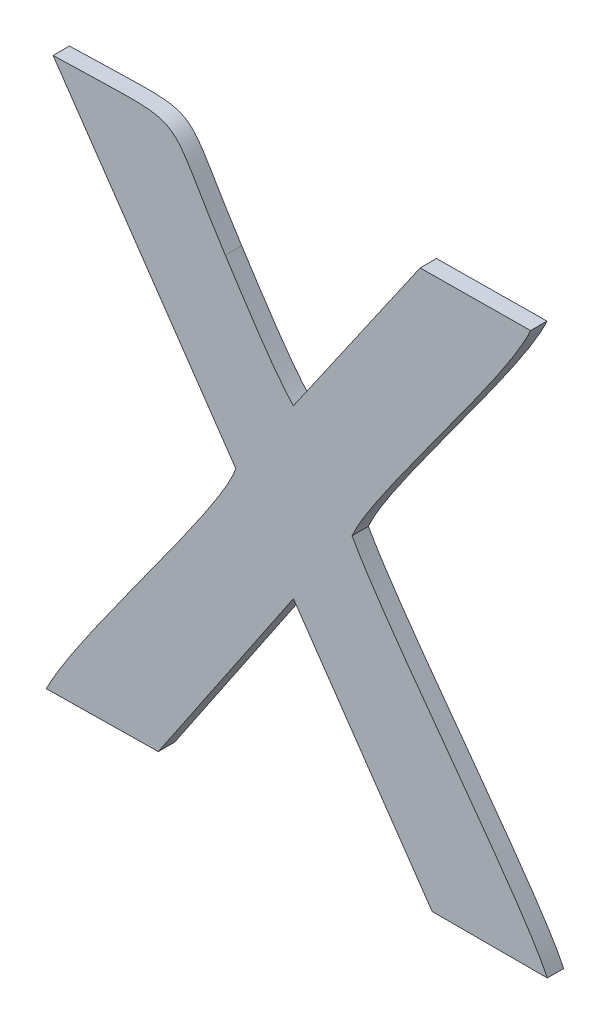
ISO-10303-21;
HEADER;
FILE_DESCRIPTION(('STEP AP214'),'2;1');
FILE_NAME('part.step','',(''),(''),'','','');
FILE_SCHEMA(('AUTOMOTIVE_DESIGN { 1 0 10303 214 1 1 1 1 }'));
ENDSEC;
DATA;
#1=APPLICATION_CONTEXT('core data for automotive mechanical design processes');
#2=APPLICATION_PROTOCOL_DEFINITION('international standard','automotive_design',2000,#1);
#3=PRODUCT_CONTEXT('',#1,'mechanical');
#4=PRODUCT('Part','Part','',(#3));
#5=PRODUCT_RELATED_PRODUCT_CATEGORY('part','',(#4));
#6=PRODUCT_DEFINITION_FORMATION('','',#4);
#7=PRODUCT_DEFINITION_CONTEXT('part definition',#1,'design');
#8=PRODUCT_DEFINITION('design','',#6,#7);
#9=PRODUCT_DEFINITION_SHAPE('','',#8);
#10=(LENGTH_UNIT() NAMED_UNIT(*) SI_UNIT(.MILLI.,.METRE.));
#11=(NAMED_UNIT(*) PLANE_ANGLE_UNIT() SI_UNIT($,.RADIAN.));
#12=(NAMED_UNIT(*) SI_UNIT($,.STERADIAN.) SOLID_ANGLE_UNIT());
#13=UNCERTAINTY_MEASURE_WITH_UNIT(LENGTH_MEASURE(1.E-05),#10,'distance_accuracy_value','');
#14=(GEOMETRIC_REPRESENTATION_CONTEXT(3) GLOBAL_UNCERTAINTY_ASSIGNED_CONTEXT((#13)) GLOBAL_UNIT_ASSIGNED_CONTEXT((#10,
#11,#12)) REPRESENTATION_CONTEXT('',''));
#15=CARTESIAN_POINT('',(0.,0.,0.));
#16=DIRECTION('',(0.,0.,1.));
#17=DIRECTION('',(1.,0.,0.));
#18=AXIS2_PLACEMENT_3D('',#15,#16,#17);
#19=CARTESIAN_POINT('',(-1.8810139453125,-48.558446796875,0.000999999999999998));
#20=CARTESIAN_POINT('',(-1.8810139453125,-48.558446796875,0.));
#21=CARTESIAN_POINT('',(-1.88219765625,-48.5572630859375,0.000999999999999998));
#22=CARTESIAN_POINT('',(-1.88219765625,-48.5572630859375,0.));
#23=CARTESIAN_POINT('',(-1.8842131640625,-48.554031875,0.000999999999999998));
#24=CARTESIAN_POINT('',(-1.8842131640625,-48.554031875,0.));
#25=CARTESIAN_POINT('',(-1.8851729296875,-48.552560234375,0.000999999999999998));
#26=CARTESIAN_POINT('',(-1.8851729296875,-48.552560234375,0.));
#27=B_SPLINE_SURFACE_WITH_KNOTS('',3,1,((#19,#20),(#21,#22),(#23,#24),(#25,#26)),.UNSPECIFIED.,
.F.,.F.,.F.,(4,4),(2,2),(0.692307692307692,0.769230769230769),(0.,1.),.UNSPECIFIED.);
#28=CARTESIAN_POINT('',(-1.8810139453125,-48.558446796875,0.));
#29=CARTESIAN_POINT('',(-1.88219765625,-48.5572630859375,0.));
#30=CARTESIAN_POINT('',(-1.8842131640625,-48.554031875,0.));
#31=CARTESIAN_POINT('',(-1.8851729296875,-48.552560234375,0.));
#32=B_SPLINE_CURVE_WITH_KNOTS('',3,(#28,#29,#30,#31),.UNSPECIFIED.,.F.,.F.,(4,4),
(0.692307692307692,0.769230769230769),.UNSPECIFIED.);
#33=CARTESIAN_POINT('',(-1.8810139453125,-48.558446796875,0.));
#34=VERTEX_POINT('',#33);
#35=CARTESIAN_POINT('',(-1.8851729296875,-48.552560234375,0.));
#36=VERTEX_POINT('',#35);
#37=EDGE_CURVE('E11',#34,#36,#32,.T.);
#38=DIRECTION('',(0.,0.,-1.));
#39=VECTOR('',#38,1.);
#40=CARTESIAN_POINT('',(-1.8851729296875,-48.552560234375,0.000999999999999998));
#41=LINE('',#40,#39);
#42=CARTESIAN_POINT('',(-1.8851729296875,-48.552560234375,0.000999999999999998));
#43=VERTEX_POINT('',#42);
#44=EDGE_CURVE('E28',#43,#36,#41,.T.);
#45=CARTESIAN_POINT('',(-1.8810139453125,-48.558446796875,0.001));
#46=CARTESIAN_POINT('',(-1.88219765625,-48.5572630859375,0.000999999999999998));
#47=CARTESIAN_POINT('',(-1.8842131640625,-48.554031875,0.000999999999999998));
#48=CARTESIAN_POINT('',(-1.8851729296875,-48.552560234375,0.000999999999999998));
#49=B_SPLINE_CURVE_WITH_KNOTS('',3,(#45,#46,#47,#48),.UNSPECIFIED.,.F.,.F.,(4,4),
(0.692307692307692,0.769230769230769),.UNSPECIFIED.);
#50=CARTESIAN_POINT('',(-1.8810139453125,-48.558446796875,0.001));
#51=VERTEX_POINT('',#50);
#52=EDGE_CURVE('E241',#51,#43,#49,.T.);
#53=DIRECTION('',(0.,0.,-1.));
#54=VECTOR('',#53,1.);
#55=CARTESIAN_POINT('',(-1.8810139453125,-48.558446796875,0.001));
#56=LINE('',#55,#54);
#57=EDGE_CURVE('E40',#51,#34,#56,.T.);
#58=ORIENTED_EDGE('',*,*,#37,.T.);
#59=ORIENTED_EDGE('',*,*,#44,.F.);
#60=ORIENTED_EDGE('',*,*,#52,.F.);
#61=ORIENTED_EDGE('',*,*,#57,.T.);
#62=EDGE_LOOP('',(#58,#59,#60,#61));
#63=FACE_BOUND('',#62,.T.);
#64=ADVANCED_FACE('F17',(#63),#27,.F.);
#65=CARTESIAN_POINT('',(-1.8851729296875,-48.552560234375,0.001));
#66=CARTESIAN_POINT('',(-1.8851729296875,-48.552560234375,0.));
#67=CARTESIAN_POINT('',(-1.8892359375,-48.5463217578125,0.001));
#68=CARTESIAN_POINT('',(-1.8892359375,-48.5463217578125,0.));
#69=CARTESIAN_POINT('',(-1.8869325,-48.5470895703125,0.001));
#70=CARTESIAN_POINT('',(-1.8869325,-48.5470895703125,0.));
#71=CARTESIAN_POINT('',(-1.895698359375,-48.54724953125,0.001));
#72=CARTESIAN_POINT('',(-1.895698359375,-48.54724953125,0.));
#73=B_SPLINE_SURFACE_WITH_KNOTS('',3,1,((#65,#66),(#67,#68),(#69,#70),(#71,#72)),.UNSPECIFIED.,
.F.,.F.,.F.,(4,4),(2,2),(0.769230769230769,0.846153846153846),(0.,1.),.UNSPECIFIED.);
#74=CARTESIAN_POINT('',(-1.8851729296875,-48.552560234375,0.));
#75=CARTESIAN_POINT('',(-1.8892359375,-48.5463217578125,0.));
#76=CARTESIAN_POINT('',(-1.8869325,-48.5470895703125,0.));
#77=CARTESIAN_POINT('',(-1.895698359375,-48.54724953125,0.));
#78=B_SPLINE_CURVE_WITH_KNOTS('',3,(#74,#75,#76,#77),.UNSPECIFIED.,.F.,.F.,(4,4),
(0.769230769230769,0.846153846153846),.UNSPECIFIED.);
#79=CARTESIAN_POINT('',(-1.895698359375,-48.54724953125,0.));
#80=VERTEX_POINT('',#79);
#81=EDGE_CURVE('E233',#36,#80,#78,.T.);
#82=DIRECTION('',(0.,0.,-1.));
#83=VECTOR('',#82,1.);
#84=CARTESIAN_POINT('',(-1.895698359375,-48.54724953125,0.001));
#85=LINE('',#84,#83);
#86=CARTESIAN_POINT('',(-1.895698359375,-48.54724953125,0.001));
#87=VERTEX_POINT('',#86);
#88=EDGE_CURVE('E228',#87,#80,#85,.T.);
#89=CARTESIAN_POINT('',(-1.8851729296875,-48.552560234375,0.000999999999999998));
#90=CARTESIAN_POINT('',(-1.8892359375,-48.5463217578125,0.001));
#91=CARTESIAN_POINT('',(-1.8869325,-48.5470895703125,0.001));
#92=CARTESIAN_POINT('',(-1.895698359375,-48.54724953125,0.001));
#93=B_SPLINE_CURVE_WITH_KNOTS('',3,(#89,#90,#91,#92),.UNSPECIFIED.,.F.,.F.,(4,4),
(0.769230769230769,0.846153846153846),.UNSPECIFIED.);
#94=EDGE_CURVE('E224',#43,#87,#93,.T.);
#95=ORIENTED_EDGE('',*,*,#81,.T.);
#96=ORIENTED_EDGE('',*,*,#88,.F.);
#97=ORIENTED_EDGE('',*,*,#94,.F.);
#98=ORIENTED_EDGE('',*,*,#44,.T.);
#99=EDGE_LOOP('',(#95,#96,#97,#98));
#100=FACE_BOUND('',#99,.T.);
#101=ADVANCED_FACE('F249',(#100),#73,.F.);
#102=CARTESIAN_POINT('',(-23.9316149900033,-16.4089069381147,0.001));
#103=DIRECTION('',(0.824750443714158,0.565496866121554,0.));
#104=DIRECTION('',(-0.565496866121554,0.824750443714158,0.));
#105=AXIS2_PLACEMENT_3D('',#102,#103,#104);
#106=PLANE('',#105);
#107=DIRECTION('',(0.565496866121554,-0.824750443714158,0.));
#108=VECTOR('',#107,1.);
#109=CARTESIAN_POINT('',(-23.9316149900033,-16.4089069381147,0.));
#110=LINE('',#109,#108);
#111=CARTESIAN_POINT('',(-1.8845330859375,-48.5635335546875,0.));
#112=VERTEX_POINT('',#111);
#113=EDGE_CURVE('E222',#80,#112,#110,.T.);
#114=ORIENTED_EDGE('',*,*,#113,.T.);
#115=DIRECTION('',(0.,0.,-1.));
#116=VECTOR('',#115,1.);
#117=CARTESIAN_POINT('',(-1.8845330859375,-48.5635335546875,0.001));
#118=LINE('',#117,#116);
#119=CARTESIAN_POINT('',(-1.8845330859375,-48.5635335546875,0.001));
#120=VERTEX_POINT('',#119);
#121=EDGE_CURVE('E219',#120,#112,#118,.T.);
#122=ORIENTED_EDGE('',*,*,#121,.F.);
#123=DIRECTION('',(0.565496866121554,-0.824750443714158,0.));
#124=VECTOR('',#123,1.);
#125=CARTESIAN_POINT('',(-23.9316149900033,-16.4089069381147,0.001));
#126=LINE('',#125,#124);
#127=EDGE_CURVE('E213',#87,#120,#126,.T.);
#128=ORIENTED_EDGE('',*,*,#127,.F.);
#129=ORIENTED_EDGE('',*,*,#88,.T.);
#130=EDGE_LOOP('',(#114,#122,#128,#129));
#131=FACE_BOUND('',#130,.T.);
#132=ADVANCED_FACE('F253',(#131),#106,.F.);
#133=CARTESIAN_POINT('',(-1.8845330859375,-48.5635335546875,0.001));
#134=CARTESIAN_POINT('',(-1.8845330859375,-48.5635335546875,0.));
#135=CARTESIAN_POINT('',(-1.885460859375,-48.566316875,0.001));
#136=CARTESIAN_POINT('',(-1.885460859375,-48.566316875,0.));
#137=CARTESIAN_POINT('',(-1.8940027734375,-48.576746328125,0.001));
#138=CARTESIAN_POINT('',(-1.8940027734375,-48.576746328125,0.));
#139=CARTESIAN_POINT('',(-1.8961142578125,-48.580969296875,0.001));
#140=CARTESIAN_POINT('',(-1.8961142578125,-48.580969296875,0.));
#141=B_SPLINE_SURFACE_WITH_KNOTS('',3,1,((#133,#134),(#135,#136),(#137,#138),(#139,#140)),
.UNSPECIFIED.,.F.,.F.,.F.,(4,4),(2,2),(0.,0.0769230769230769),(0.,1.),.UNSPECIFIED.);
#142=CARTESIAN_POINT('',(-1.8845330859375,-48.5635335546875,0.));
#143=CARTESIAN_POINT('',(-1.885460859375,-48.566316875,0.));
#144=CARTESIAN_POINT('',(-1.8940027734375,-48.576746328125,0.));
#145=CARTESIAN_POINT('',(-1.8961142578125,-48.580969296875,0.));
#146=B_SPLINE_CURVE_WITH_KNOTS('',3,(#142,#143,#144,#145),.UNSPECIFIED.,.F.,.F.,(4,4),(0.,
0.0769230769230769),.UNSPECIFIED.);
#147=CARTESIAN_POINT('',(-1.8961142578125,-48.580969296875,0.));
#148=VERTEX_POINT('',#147);
#149=EDGE_CURVE('E208',#112,#148,#146,.T.);
#150=DIRECTION('',(0.,0.,-1.));
#151=VECTOR('',#150,1.);
#152=CARTESIAN_POINT('',(-1.8961142578125,-48.580969296875,0.001));
#153=LINE('',#152,#151);
#154=CARTESIAN_POINT('',(-1.8961142578125,-48.580969296875,0.001));
#155=VERTEX_POINT('',#154);
#156=EDGE_CURVE('E203',#155,#148,#153,.T.);
#157=CARTESIAN_POINT('',(-1.8845330859375,-48.5635335546875,0.001));
#158=CARTESIAN_POINT('',(-1.885460859375,-48.566316875,0.001));
#159=CARTESIAN_POINT('',(-1.8940027734375,-48.576746328125,0.001));
#160=CARTESIAN_POINT('',(-1.8961142578125,-48.580969296875,0.001));
#161=B_SPLINE_CURVE_WITH_KNOTS('',3,(#157,#158,#159,#160),.UNSPECIFIED.,.F.,.F.,(4,4),(0.,
0.0769230769230769),.UNSPECIFIED.);
#162=EDGE_CURVE('E199',#120,#155,#161,.T.);
#163=ORIENTED_EDGE('',*,*,#149,.T.);
#164=ORIENTED_EDGE('',*,*,#156,.F.);
#165=ORIENTED_EDGE('',*,*,#162,.F.);
#166=ORIENTED_EDGE('',*,*,#121,.T.);
#167=EDGE_LOOP('',(#163,#164,#165,#166));
#168=FACE_BOUND('',#167,.T.);
#169=ADVANCED_FACE('F257',(#168),#141,.F.);
#170=CARTESIAN_POINT('',(0.680535252947519,-48.5448480420501,0.001));
#171=DIRECTION('',(-0.014017314289563,0.99990175262378,0.));
#172=DIRECTION('',(-0.99990175262378,-0.014017314289563,0.));
#173=AXIS2_PLACEMENT_3D('',#170,#171,#172);
#174=PLANE('',#173);
#175=DIRECTION('',(0.99990175262378,0.014017314289563,0.));
#176=VECTOR('',#175,1.);
#177=CARTESIAN_POINT('',(0.680535252947519,-48.5448480420501,0.));
#178=LINE('',#177,#176);
#179=CARTESIAN_POINT('',(-1.8892679296875,-48.5808733203125,0.));
#180=VERTEX_POINT('',#179);
#181=EDGE_CURVE('E197',#148,#180,#178,.T.);
#182=ORIENTED_EDGE('',*,*,#181,.T.);
#183=DIRECTION('',(0.,0.,-1.));
#184=VECTOR('',#183,1.);
#185=CARTESIAN_POINT('',(-1.8892679296875,-48.5808733203125,0.001));
#186=LINE('',#185,#184);
#187=CARTESIAN_POINT('',(-1.8892679296875,-48.5808733203125,0.001));
#188=VERTEX_POINT('',#187);
#189=EDGE_CURVE('E194',#188,#180,#186,.T.);
#190=ORIENTED_EDGE('',*,*,#189,.F.);
#191=DIRECTION('',(0.99990175262378,0.014017314289563,0.));
#192=VECTOR('',#191,1.);
#193=CARTESIAN_POINT('',(0.680535252947519,-48.5448480420501,0.001));
#194=LINE('',#193,#192);
#195=EDGE_CURVE('E191',#155,#188,#194,.T.);
#196=ORIENTED_EDGE('',*,*,#195,.F.);
#197=ORIENTED_EDGE('',*,*,#156,.T.);
#198=EDGE_LOOP('',(#182,#190,#196,#197));
#199=FACE_BOUND('',#198,.T.);
#200=ADVANCED_FACE('F262',(#199),#174,.F.);
#201=CARTESIAN_POINT('',(21.2353027822087,-14.3421678476768,0.001));
#202=DIRECTION('',(-0.828697747722122,0.559696384587468,0.));
#203=DIRECTION('',(-0.559696384587468,-0.828697747722122,0.));
#204=AXIS2_PLACEMENT_3D('',#201,#202,#203);
#205=PLANE('',#204);
#206=DIRECTION('',(0.559696384587468,0.828697747722122,0.));
#207=VECTOR('',#206,1.);
#208=CARTESIAN_POINT('',(21.2353027822087,-14.3421678476768,0.));
#209=LINE('',#208,#207);
#210=CARTESIAN_POINT('',(-1.8810139453125,-48.5686523046875,0.));
#211=VERTEX_POINT('',#210);
#212=EDGE_CURVE('E189',#180,#211,#209,.T.);
#213=ORIENTED_EDGE('',*,*,#212,.T.);
#214=DIRECTION('',(0.,0.,-1.));
#215=VECTOR('',#214,1.);
#216=CARTESIAN_POINT('',(-1.8810139453125,-48.5686523046875,0.001));
#217=LINE('',#216,#215);
#218=CARTESIAN_POINT('',(-1.8810139453125,-48.5686523046875,0.001));
#219=VERTEX_POINT('',#218);
#220=EDGE_CURVE('E186',#219,#211,#217,.T.);
#221=ORIENTED_EDGE('',*,*,#220,.F.);
#222=DIRECTION('',(0.559696384587468,0.828697747722122,0.));
#223=VECTOR('',#222,1.);
#224=CARTESIAN_POINT('',(21.2353027822087,-14.3421678476768,0.001));
#225=LINE('',#224,#223);
#226=EDGE_CURVE('E183',#188,#219,#225,.T.);
#227=ORIENTED_EDGE('',*,*,#226,.F.);
#228=ORIENTED_EDGE('',*,*,#189,.T.);
#229=EDGE_LOOP('',(#213,#221,#227,#228));
#230=FACE_BOUND('',#229,.T.);
#231=ADVANCED_FACE('F266',(#230),#205,.F.);
#232=CARTESIAN_POINT('',(-23.9598537122,-16.4918473603496,0.001));
#233=DIRECTION('',(0.82372966208049,0.566982754419181,0.));
#234=DIRECTION('',(-0.566982754419181,0.82372966208049,0.));
#235=AXIS2_PLACEMENT_3D('',#232,#233,#234);
#236=PLANE('',#235);
#237=DIRECTION('',(0.566982754419181,-0.82372966208049,0.));
#238=VECTOR('',#237,1.);
#239=CARTESIAN_POINT('',(-23.9598537122,-16.4918473603496,0.));
#240=LINE('',#239,#238);
#241=CARTESIAN_POINT('',(-1.872536015625,-48.580969296875,0.));
#242=VERTEX_POINT('',#241);
#243=EDGE_CURVE('E181',#211,#242,#240,.T.);
#244=ORIENTED_EDGE('',*,*,#243,.T.);
#245=DIRECTION('',(0.,0.,-1.));
#246=VECTOR('',#245,1.);
#247=CARTESIAN_POINT('',(-1.872536015625,-48.580969296875,0.001));
#248=LINE('',#247,#246);
#249=CARTESIAN_POINT('',(-1.872536015625,-48.580969296875,0.001));
#250=VERTEX_POINT('',#249);
#251=EDGE_CURVE('E178',#250,#242,#248,.T.);
#252=ORIENTED_EDGE('',*,*,#251,.F.);
#253=DIRECTION('',(0.566982754419181,-0.82372966208049,0.));
#254=VECTOR('',#253,1.);
#255=CARTESIAN_POINT('',(-23.9598537122,-16.4918473603496,0.001));
#256=LINE('',#255,#254);
#257=EDGE_CURVE('E175',#219,#250,#256,.T.);
#258=ORIENTED_EDGE('',*,*,#257,.F.);
#259=ORIENTED_EDGE('',*,*,#220,.T.);
#260=EDGE_LOOP('',(#244,#252,#258,#259));
#261=FACE_BOUND('',#260,.T.);
#262=ADVANCED_FACE('F270',(#261),#236,.F.);
#263=CARTESIAN_POINT('',(0.,-48.580969296875,0.001));
#264=DIRECTION('',(0.,1.,0.));
#265=DIRECTION('',(0.,0.,1.));
#266=AXIS2_PLACEMENT_3D('',#263,#264,#265);
#267=PLANE('',#266);
#268=DIRECTION('',(1.,0.,0.));
#269=VECTOR('',#268,1.);
#270=CARTESIAN_POINT('',(0.,-48.580969296875,0.));
#271=LINE('',#270,#269);
#272=CARTESIAN_POINT('',(-1.865497734375,-48.580969296875,0.));
#273=VERTEX_POINT('',#272);
#274=EDGE_CURVE('E173',#242,#273,#271,.T.);
#275=ORIENTED_EDGE('',*,*,#274,.T.);
#276=DIRECTION('',(0.,0.,-1.));
#277=VECTOR('',#276,1.);
#278=CARTESIAN_POINT('',(-1.865497734375,-48.580969296875,0.001));
#279=LINE('',#278,#277);
#280=CARTESIAN_POINT('',(-1.865497734375,-48.580969296875,0.001));
#281=VERTEX_POINT('',#280);
#282=EDGE_CURVE('E170',#281,#273,#279,.T.);
#283=ORIENTED_EDGE('',*,*,#282,.F.);
#284=DIRECTION('',(1.,0.,0.));
#285=VECTOR('',#284,1.);
#286=CARTESIAN_POINT('',(0.,-48.580969296875,0.001));
#287=LINE('',#286,#285);
#288=EDGE_CURVE('E164',#250,#281,#287,.T.);
#289=ORIENTED_EDGE('',*,*,#288,.F.);
#290=ORIENTED_EDGE('',*,*,#251,.T.);
#291=EDGE_LOOP('',(#275,#283,#289,#290));
#292=FACE_BOUND('',#291,.T.);
#293=ADVANCED_FACE('F277',(#292),#267,.F.);
#294=CARTESIAN_POINT('',(-1.865497734375,-48.580969296875,0.001));
#295=CARTESIAN_POINT('',(-1.865497734375,-48.580969296875,0.));
#296=CARTESIAN_POINT('',(-1.8671293359375,-48.577514140625,0.001));
#297=CARTESIAN_POINT('',(-1.8671293359375,-48.577514140625,0.));
#298=CARTESIAN_POINT('',(-1.875095390625,-48.5677565234375,0.001));
#299=CARTESIAN_POINT('',(-1.875095390625,-48.5677565234375,0.));
#300=CARTESIAN_POINT('',(-1.8774308203125,-48.5635335546875,0.001));
#301=CARTESIAN_POINT('',(-1.8774308203125,-48.5635335546875,0.));
#302=B_SPLINE_SURFACE_WITH_KNOTS('',3,1,((#294,#295),(#296,#297),(#298,#299),(#300,#301)),
.UNSPECIFIED.,.F.,.F.,.F.,(4,4),(2,2),(0.384615384615385,0.461538461538462),(0.,1.),.UNSPECIFIED.);
#303=CARTESIAN_POINT('',(-1.865497734375,-48.580969296875,0.));
#304=CARTESIAN_POINT('',(-1.8671293359375,-48.577514140625,0.));
#305=CARTESIAN_POINT('',(-1.875095390625,-48.5677565234375,0.));
#306=CARTESIAN_POINT('',(-1.8774308203125,-48.5635335546875,0.));
#307=B_SPLINE_CURVE_WITH_KNOTS('',3,(#303,#304,#305,#306),.UNSPECIFIED.,.F.,.F.,(4,4),
(0.384615384615385,0.461538461538462),.UNSPECIFIED.);
#308=CARTESIAN_POINT('',(-1.8774308203125,-48.5635335546875,0.));
#309=VERTEX_POINT('',#308);
#310=EDGE_CURVE('E159',#273,#309,#307,.T.);
#311=DIRECTION('',(0.,0.,-1.));
#312=VECTOR('',#311,1.);
#313=CARTESIAN_POINT('',(-1.8774308203125,-48.5635335546875,0.001));
#314=LINE('',#313,#312);
#315=CARTESIAN_POINT('',(-1.8774308203125,-48.5635335546875,0.001));
#316=VERTEX_POINT('',#315);
#317=EDGE_CURVE('E154',#316,#309,#314,.T.);
#318=CARTESIAN_POINT('',(-1.865497734375,-48.580969296875,0.001));
#319=CARTESIAN_POINT('',(-1.8671293359375,-48.577514140625,0.001));
#320=CARTESIAN_POINT('',(-1.875095390625,-48.5677565234375,0.001));
#321=CARTESIAN_POINT('',(-1.8774308203125,-48.5635335546875,0.001));
#322=B_SPLINE_CURVE_WITH_KNOTS('',3,(#318,#319,#320,#321),.UNSPECIFIED.,.F.,.F.,(4,4),
(0.384615384615385,0.461538461538462),.UNSPECIFIED.);
#323=EDGE_CURVE('E147',#281,#316,#322,.T.);
#324=ORIENTED_EDGE('',*,*,#310,.T.);
#325=ORIENTED_EDGE('',*,*,#317,.F.);
#326=ORIENTED_EDGE('',*,*,#323,.F.);
#327=ORIENTED_EDGE('',*,*,#282,.T.);
#328=EDGE_LOOP('',(#324,#325,#326,#327));
#329=FACE_BOUND('',#328,.T.);
#330=ADVANCED_FACE('F281',(#329),#302,.F.);
#331=CARTESIAN_POINT('',(-1.8774308203125,-48.5635335546875,0.001));
#332=CARTESIAN_POINT('',(-1.8774308203125,-48.5635335546875,0.));
#333=CARTESIAN_POINT('',(-1.8761511328125,-48.5605262890625,0.001));
#334=CARTESIAN_POINT('',(-1.8761511328125,-48.5605262890625,0.));
#335=CARTESIAN_POINT('',(-1.867993125,-48.5506087109375,0.001));
#336=CARTESIAN_POINT('',(-1.867993125,-48.5506087109375,0.));
#337=CARTESIAN_POINT('',(-1.866521484375,-48.5472175390625,0.001));
#338=CARTESIAN_POINT('',(-1.866521484375,-48.5472175390625,0.));
#339=B_SPLINE_SURFACE_WITH_KNOTS('',3,1,((#331,#332),(#333,#334),(#335,#336),(#337,#338)),
.UNSPECIFIED.,.F.,.F.,.F.,(4,4),(2,2),(0.461538461538462,0.538461538461538),(0.,1.),.UNSPECIFIED.);
#340=CARTESIAN_POINT('',(-1.8774308203125,-48.5635335546875,0.));
#341=CARTESIAN_POINT('',(-1.8761511328125,-48.5605262890625,0.));
#342=CARTESIAN_POINT('',(-1.867993125,-48.5506087109375,0.));
#343=CARTESIAN_POINT('',(-1.866521484375,-48.5472175390625,0.));
#344=B_SPLINE_CURVE_WITH_KNOTS('',3,(#340,#341,#342,#343),.UNSPECIFIED.,.F.,.F.,(4,4),
(0.461538461538462,0.538461538461538),.UNSPECIFIED.);
#345=CARTESIAN_POINT('',(-1.866521484375,-48.5472175390625,0.));
#346=VERTEX_POINT('',#345);
#347=EDGE_CURVE('E142',#309,#346,#344,.T.);
#348=DIRECTION('',(0.,0.,-1.));
#349=VECTOR('',#348,1.);
#350=CARTESIAN_POINT('',(-1.866521484375,-48.5472175390625,0.001));
#351=LINE('',#350,#349);
#352=CARTESIAN_POINT('',(-1.866521484375,-48.5472175390625,0.001));
#353=VERTEX_POINT('',#352);
#354=EDGE_CURVE('E137',#353,#346,#351,.T.);
#355=CARTESIAN_POINT('',(-1.8774308203125,-48.5635335546875,0.001));
#356=CARTESIAN_POINT('',(-1.8761511328125,-48.5605262890625,0.001));
#357=CARTESIAN_POINT('',(-1.867993125,-48.5506087109375,0.001));
#358=CARTESIAN_POINT('',(-1.866521484375,-48.5472175390625,0.001));
#359=B_SPLINE_CURVE_WITH_KNOTS('',3,(#355,#356,#357,#358),.UNSPECIFIED.,.F.,.F.,(4,4),
(0.461538461538462,0.538461538461538),.UNSPECIFIED.);
#360=EDGE_CURVE('E125',#316,#353,#359,.T.);
#361=ORIENTED_EDGE('',*,*,#347,.T.);
#362=ORIENTED_EDGE('',*,*,#354,.F.);
#363=ORIENTED_EDGE('',*,*,#360,.F.);
#364=ORIENTED_EDGE('',*,*,#317,.T.);
#365=EDGE_LOOP('',(#361,#362,#363,#364));
#366=FACE_BOUND('',#365,.T.);
#367=ADVANCED_FACE('F284',(#366),#339,.F.);
#368=CARTESIAN_POINT('',(0.459954176702404,-48.5251656370595,0.001));
#369=DIRECTION('',(0.0094782472086255,-0.999955080406041,0.));
#370=DIRECTION('',(0.999955080406041,0.0094782472086255,0.));
#371=AXIS2_PLACEMENT_3D('',#368,#369,#370);
#372=PLANE('',#371);
#373=DIRECTION('',(-0.999955080406041,-0.0094782472086255,0.));
#374=VECTOR('',#373,1.);
#375=CARTESIAN_POINT('',(0.459954176702404,-48.5251656370595,0.));
#376=LINE('',#375,#374);
#377=CARTESIAN_POINT('',(-1.8732718359375,-48.5472815234375,0.));
#378=VERTEX_POINT('',#377);
#379=EDGE_CURVE('E114',#346,#378,#376,.T.);
#380=ORIENTED_EDGE('',*,*,#379,.T.);
#381=DIRECTION('',(0.,0.,-1.));
#382=VECTOR('',#381,1.);
#383=CARTESIAN_POINT('',(-1.8732718359375,-48.5472815234375,0.001));
#384=LINE('',#383,#382);
#385=CARTESIAN_POINT('',(-1.8732718359375,-48.5472815234375,0.001));
#386=VERTEX_POINT('',#385);
#387=EDGE_CURVE('E109',#386,#378,#384,.T.);
#388=ORIENTED_EDGE('',*,*,#387,.F.);
#389=DIRECTION('',(-0.999955080406041,-0.0094782472086255,0.));
#390=VECTOR('',#389,1.);
#391=CARTESIAN_POINT('',(0.459954176702404,-48.5251656370595,0.001));
#392=LINE('',#391,#390);
#393=EDGE_CURVE('E112',#353,#386,#392,.T.);
#394=ORIENTED_EDGE('',*,*,#393,.F.);
#395=ORIENTED_EDGE('',*,*,#354,.T.);
#396=EDGE_LOOP('',(#380,#388,#394,#395));
#397=FACE_BOUND('',#396,.T.);
#398=ADVANCED_FACE('F111',(#397),#372,.F.);
#399=CARTESIAN_POINT('',(21.4678009592606,-14.8859823270479,0.001));
#400=DIRECTION('',(0.821768129154098,-0.56982202651931,0.));
#401=DIRECTION('',(0.56982202651931,0.821768129154098,0.));
#402=AXIS2_PLACEMENT_3D('',#399,#400,#401);
#403=PLANE('',#402);
#404=DIRECTION('',(-0.56982202651931,-0.821768129154098,0.));
#405=VECTOR('',#404,1.);
#406=CARTESIAN_POINT('',(21.4678009592606,-14.8859823270479,0.));
#407=LINE('',#406,#405);
#408=EDGE_CURVE('E127',#378,#34,#407,.T.);
#409=ORIENTED_EDGE('',*,*,#408,.T.);
#410=ORIENTED_EDGE('',*,*,#57,.F.);
#411=DIRECTION('',(-0.56982202651931,-0.821768129154098,0.));
#412=VECTOR('',#411,1.);
#413=CARTESIAN_POINT('',(21.4678009592606,-14.8859823270479,0.001));
#414=LINE('',#413,#412);
#415=EDGE_CURVE('E123',#386,#51,#414,.T.);
#416=ORIENTED_EDGE('',*,*,#415,.F.);
#417=ORIENTED_EDGE('',*,*,#387,.T.);
#418=EDGE_LOOP('',(#409,#410,#416,#417));
#419=FACE_BOUND('',#418,.T.);
#420=ADVANCED_FACE('F129',(#419),#403,.F.);
#421=CARTESIAN_POINT('',(0.,0.,0.001));
#422=DIRECTION('',(0.,0.,1.));
#423=DIRECTION('',(1.,0.,0.));
#424=AXIS2_PLACEMENT_3D('',#421,#422,#423);
#425=PLANE('',#424);
#426=ORIENTED_EDGE('',*,*,#52,.T.);
#427=ORIENTED_EDGE('',*,*,#94,.T.);
#428=ORIENTED_EDGE('',*,*,#127,.T.);
#429=ORIENTED_EDGE('',*,*,#162,.T.);
#430=ORIENTED_EDGE('',*,*,#195,.T.);
#431=ORIENTED_EDGE('',*,*,#226,.T.);
#432=ORIENTED_EDGE('',*,*,#257,.T.);
#433=ORIENTED_EDGE('',*,*,#288,.T.);
#434=ORIENTED_EDGE('',*,*,#323,.T.);
#435=ORIENTED_EDGE('',*,*,#360,.T.);
#436=ORIENTED_EDGE('',*,*,#393,.T.);
#437=ORIENTED_EDGE('',*,*,#415,.T.);
#438=EDGE_LOOP('',(#426,#427,#428,#429,#430,#431,#432,#433,#434,#435,#436,#437));
#439=FACE_BOUND('',#438,.T.);
#440=ADVANCED_FACE('F122',(#439),#425,.T.);
#441=CARTESIAN_POINT('',(0.,0.,0.));
#442=DIRECTION('',(0.,0.,1.));
#443=DIRECTION('',(1.,0.,0.));
#444=AXIS2_PLACEMENT_3D('',#441,#442,#443);
#445=PLANE('',#444);
#446=ORIENTED_EDGE('',*,*,#37,.F.);
#447=ORIENTED_EDGE('',*,*,#408,.F.);
#448=ORIENTED_EDGE('',*,*,#379,.F.);
#449=ORIENTED_EDGE('',*,*,#347,.F.);
#450=ORIENTED_EDGE('',*,*,#310,.F.);
#451=ORIENTED_EDGE('',*,*,#274,.F.);
#452=ORIENTED_EDGE('',*,*,#243,.F.);
#453=ORIENTED_EDGE('',*,*,#212,.F.);
#454=ORIENTED_EDGE('',*,*,#181,.F.);
#455=ORIENTED_EDGE('',*,*,#149,.F.);
#456=ORIENTED_EDGE('',*,*,#113,.F.);
#457=ORIENTED_EDGE('',*,*,#81,.F.);
#458=EDGE_LOOP('',(#446,#447,#448,#449,#450,#451,#452,#453,#454,#455,#456,#457));
#459=FACE_BOUND('',#458,.T.);
#460=ADVANCED_FACE('F273',(#459),#445,.F.);
#461=CLOSED_SHELL('',(#64,#101,#132,#169,#200,#231,#262,#293,#330,#367,#398,#420,#440,#460));
#462=MANIFOLD_SOLID_BREP('B1',#461);
#463=ADVANCED_BREP_SHAPE_REPRESENTATION('',(#18,#462),#14);
#464=SHAPE_DEFINITION_REPRESENTATION(#9,#463);
ENDSEC;
END-ISO-10303-21;
